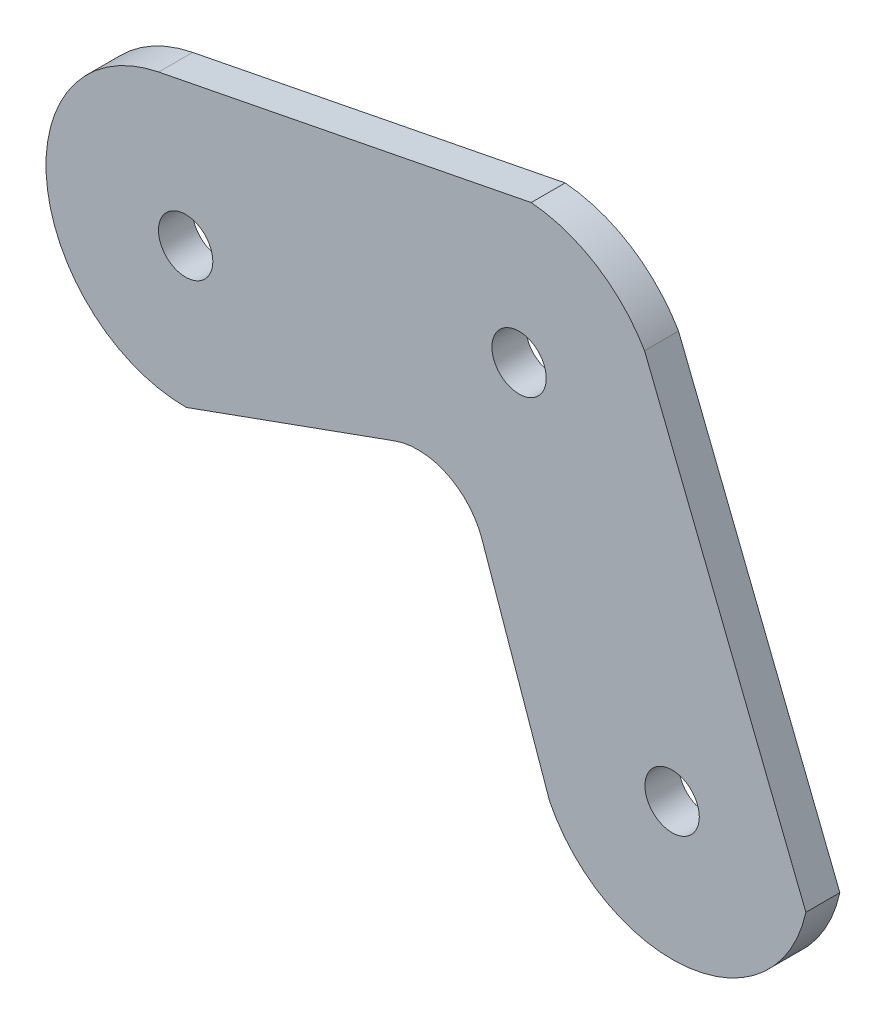
ISO-10303-21;
HEADER;
FILE_DESCRIPTION(('STEP AP214'),'2;1');
FILE_NAME('part.step','',(''),(''),'','','');
FILE_SCHEMA(('AUTOMOTIVE_DESIGN { 1 0 10303 214 1 1 1 1 }'));
ENDSEC;
DATA;
#1=APPLICATION_CONTEXT('core data for automotive mechanical design processes');
#2=APPLICATION_PROTOCOL_DEFINITION('international standard','automotive_design',2000,#1);
#3=PRODUCT_CONTEXT('',#1,'mechanical');
#4=PRODUCT('Part','Part','',(#3));
#5=PRODUCT_RELATED_PRODUCT_CATEGORY('part','',(#4));
#6=PRODUCT_DEFINITION_FORMATION('','',#4);
#7=PRODUCT_DEFINITION_CONTEXT('part definition',#1,'design');
#8=PRODUCT_DEFINITION('design','',#6,#7);
#9=PRODUCT_DEFINITION_SHAPE('','',#8);
#10=(LENGTH_UNIT() NAMED_UNIT(*) SI_UNIT(.MILLI.,.METRE.));
#11=(NAMED_UNIT(*) PLANE_ANGLE_UNIT() SI_UNIT($,.RADIAN.));
#12=(NAMED_UNIT(*) SI_UNIT($,.STERADIAN.) SOLID_ANGLE_UNIT());
#13=UNCERTAINTY_MEASURE_WITH_UNIT(LENGTH_MEASURE(1.E-05),#10,'distance_accuracy_value','');
#14=(GEOMETRIC_REPRESENTATION_CONTEXT(3) GLOBAL_UNCERTAINTY_ASSIGNED_CONTEXT((#13)) GLOBAL_UNIT_ASSIGNED_CONTEXT((#10,
#11,#12)) REPRESENTATION_CONTEXT('',''));
#15=CARTESIAN_POINT('',(0.,0.,0.));
#16=DIRECTION('',(0.,0.,1.));
#17=DIRECTION('',(1.,0.,0.));
#18=AXIS2_PLACEMENT_3D('',#15,#16,#17);
#19=CARTESIAN_POINT('',(86.39961379608,30.2365007228669,5.));
#20=DIRECTION('',(0.943869814927785,0.330317684159035,0.));
#21=DIRECTION('',(-0.330317684159035,0.943869814927785,0.));
#22=AXIS2_PLACEMENT_3D('',#19,#20,#21);
#23=PLANE('',#22);
#24=DIRECTION('',(0.330317684159035,-0.943869814927785,0.));
#25=VECTOR('',#24,1.);
#26=CARTESIAN_POINT('',(86.39961379608,30.2365007228669,0.));
#27=LINE('',#26,#25);
#28=CARTESIAN_POINT('',(79.6864116349016,49.419212352661,0.));
#29=VERTEX_POINT('',#28);
#30=CARTESIAN_POINT('',(89.6143983524071,21.0503800586389,0.));
#31=VERTEX_POINT('',#30);
#32=EDGE_CURVE('E139',#29,#31,#27,.T.);
#33=ORIENTED_EDGE('',*,*,#32,.T.);
#34=DIRECTION('',(0.,0.,-1.));
#35=VECTOR('',#34,1.);
#36=CARTESIAN_POINT('',(89.6143983524071,21.0503800586389,5.));
#37=LINE('',#36,#35);
#38=CARTESIAN_POINT('',(89.6143983524071,21.0503800586389,5.));
#39=VERTEX_POINT('',#38);
#40=EDGE_CURVE('E11',#39,#31,#37,.T.);
#41=ORIENTED_EDGE('',*,*,#40,.F.);
#42=DIRECTION('',(0.330317684159035,-0.943869814927785,0.));
#43=VECTOR('',#42,1.);
#44=CARTESIAN_POINT('',(86.39961379608,30.2365007228669,5.));
#45=LINE('',#44,#43);
#46=CARTESIAN_POINT('',(79.6864116349016,49.419212352661,5.));
#47=VERTEX_POINT('',#46);
#48=EDGE_CURVE('E184',#47,#39,#45,.T.);
#49=ORIENTED_EDGE('',*,*,#48,.F.);
#50=DIRECTION('',(0.,0.,-1.));
#51=VECTOR('',#50,1.);
#52=CARTESIAN_POINT('',(79.6864116349016,49.419212352661,5.));
#53=LINE('',#52,#51);
#54=EDGE_CURVE('E126',#47,#29,#53,.T.);
#55=ORIENTED_EDGE('',*,*,#54,.T.);
#56=EDGE_LOOP('',(#33,#41,#49,#55));
#57=FACE_BOUND('',#56,.T.);
#58=ADVANCED_FACE('F34',(#57),#23,.F.);
#59=CARTESIAN_POINT('',(107.662812973354,30.,5.));
#60=DIRECTION('',(0.,0.,-1.));
#61=DIRECTION('',(-1.,0.,0.));
#62=AXIS2_PLACEMENT_3D('',#59,#60,#61);
#63=CYLINDRICAL_SURFACE('',#62,20.1454949659822);
#64=CARTESIAN_POINT('',(107.662812973354,30.,0.));
#65=DIRECTION('',(0.,0.,1.));
#66=DIRECTION('',(1.,0.,0.));
#67=AXIS2_PLACEMENT_3D('',#64,#65,#66);
#68=CIRCLE('',#67,20.1454949659822);
#69=CARTESIAN_POINT('',(127.344312528721,25.7012161398243,0.));
#70=VERTEX_POINT('',#69);
#71=EDGE_CURVE('E142',#31,#70,#68,.T.);
#72=ORIENTED_EDGE('',*,*,#71,.T.);
#73=DIRECTION('',(0.,0.,-1.));
#74=VECTOR('',#73,1.);
#75=CARTESIAN_POINT('',(127.344312528721,25.7012161398243,5.));
#76=LINE('',#75,#74);
#77=CARTESIAN_POINT('',(127.344312528721,25.7012161398243,5.));
#78=VERTEX_POINT('',#77);
#79=EDGE_CURVE('E43',#78,#70,#76,.T.);
#80=ORIENTED_EDGE('',*,*,#79,.F.);
#81=CARTESIAN_POINT('',(107.662812973354,30.,5.));
#82=DIRECTION('',(0.,0.,1.));
#83=DIRECTION('',(1.,0.,0.));
#84=AXIS2_PLACEMENT_3D('',#81,#82,#83);
#85=CIRCLE('',#84,20.1454949659822);
#86=EDGE_CURVE('E94',#39,#78,#85,.T.);
#87=ORIENTED_EDGE('',*,*,#86,.F.);
#88=ORIENTED_EDGE('',*,*,#40,.T.);
#89=EDGE_LOOP('',(#72,#80,#87,#88));
#90=FACE_BOUND('',#89,.T.);
#91=ADVANCED_FACE('F170',(#90),#63,.T.);
#92=CARTESIAN_POINT('',(118.784113908757,47.2301621060226,5.));
#93=DIRECTION('',(0.929239436564158,0.36947810426861,0.));
#94=DIRECTION('',(-0.36947810426861,0.929239436564158,0.));
#95=AXIS2_PLACEMENT_3D('',#92,#93,#94);
#96=PLANE('',#95);
#97=DIRECTION('',(0.36947810426861,-0.929239436564158,0.));
#98=VECTOR('',#97,1.);
#99=CARTESIAN_POINT('',(118.784113908757,47.2301621060226,0.));
#100=LINE('',#99,#98);
#101=CARTESIAN_POINT('',(103.609378397983,85.394704234858,0.));
#102=VERTEX_POINT('',#101);
#103=EDGE_CURVE('E145',#102,#70,#100,.T.);
#104=ORIENTED_EDGE('',*,*,#103,.F.);
#105=DIRECTION('',(0.,0.,-1.));
#106=VECTOR('',#105,1.);
#107=CARTESIAN_POINT('',(103.609378397983,85.394704234858,5.));
#108=LINE('',#107,#106);
#109=CARTESIAN_POINT('',(103.609378397983,85.394704234858,5.));
#110=VERTEX_POINT('',#109);
#111=EDGE_CURVE('E163',#110,#102,#108,.T.);
#112=ORIENTED_EDGE('',*,*,#111,.F.);
#113=DIRECTION('',(0.36947810426861,-0.929239436564158,0.));
#114=VECTOR('',#113,1.);
#115=CARTESIAN_POINT('',(118.784113908757,47.2301621060226,5.));
#116=LINE('',#115,#114);
#117=EDGE_CURVE('E169',#110,#78,#116,.T.);
#118=ORIENTED_EDGE('',*,*,#117,.T.);
#119=ORIENTED_EDGE('',*,*,#79,.T.);
#120=EDGE_LOOP('',(#104,#112,#118,#119));
#121=FACE_BOUND('',#120,.T.);
#122=ADVANCED_FACE('F167',(#121),#96,.T.);
#123=CARTESIAN_POINT('',(85.1444462247,74.6421679466076,5.));
#124=DIRECTION('',(0.,0.,-1.));
#125=DIRECTION('',(-1.,0.,0.));
#126=AXIS2_PLACEMENT_3D('',#123,#124,#125);
#127=CYLINDRICAL_SURFACE('',#126,21.3675163927421);
#128=CARTESIAN_POINT('',(85.1444462247,74.6421679466076,0.));
#129=DIRECTION('',(0.,0.,1.));
#130=DIRECTION('',(1.,0.,0.));
#131=AXIS2_PLACEMENT_3D('',#128,#129,#130);
#132=CIRCLE('',#131,21.3675163927421);
#133=CARTESIAN_POINT('',(86.9275341363037,95.9351563299603,0.));
#134=VERTEX_POINT('',#133);
#135=EDGE_CURVE('E148',#102,#134,#132,.T.);
#136=ORIENTED_EDGE('',*,*,#135,.T.);
#137=DIRECTION('',(0.,0.,-1.));
#138=VECTOR('',#137,1.);
#139=CARTESIAN_POINT('',(86.9275341363037,95.9351563299603,5.));
#140=LINE('',#139,#138);
#141=CARTESIAN_POINT('',(86.9275341363037,95.9351563299603,5.));
#142=VERTEX_POINT('',#141);
#143=EDGE_CURVE('E161',#142,#134,#140,.T.);
#144=ORIENTED_EDGE('',*,*,#143,.F.);
#145=CARTESIAN_POINT('',(85.1444462247,74.6421679466076,5.));
#146=DIRECTION('',(0.,0.,1.));
#147=DIRECTION('',(1.,0.,0.));
#148=AXIS2_PLACEMENT_3D('',#145,#146,#147);
#149=CIRCLE('',#148,21.3675163927421);
#150=EDGE_CURVE('E181',#110,#142,#149,.T.);
#151=ORIENTED_EDGE('',*,*,#150,.F.);
#152=ORIENTED_EDGE('',*,*,#111,.T.);
#153=EDGE_LOOP('',(#136,#144,#151,#152));
#154=FACE_BOUND('',#153,.T.);
#155=ADVANCED_FACE('F179',(#154),#127,.T.);
#156=CARTESIAN_POINT('',(-14.920486041365,75.9187246819285,5.));
#157=DIRECTION('',(-0.192843358932151,0.981229554648537,0.));
#158=DIRECTION('',(-0.981229554648537,-0.192843358932151,0.));
#159=AXIS2_PLACEMENT_3D('',#156,#157,#158);
#160=PLANE('',#159);
#161=DIRECTION('',(0.981229554648537,0.192843358932151,0.));
#162=VECTOR('',#161,1.);
#163=CARTESIAN_POINT('',(-14.920486041365,75.9187246819285,0.));
#164=LINE('',#163,#162);
#165=CARTESIAN_POINT('',(32.1201429811577,85.1637304647331,0.));
#166=VERTEX_POINT('',#165);
#167=EDGE_CURVE('E151',#166,#134,#164,.T.);
#168=ORIENTED_EDGE('',*,*,#167,.F.);
#169=DIRECTION('',(0.,0.,-1.));
#170=VECTOR('',#169,1.);
#171=CARTESIAN_POINT('',(32.1201429811577,85.1637304647331,5.));
#172=LINE('',#171,#170);
#173=CARTESIAN_POINT('',(32.1201429811577,85.1637304647331,5.));
#174=VERTEX_POINT('',#173);
#175=EDGE_CURVE('E121',#174,#166,#172,.T.);
#176=ORIENTED_EDGE('',*,*,#175,.F.);
#177=DIRECTION('',(0.981229554648537,0.192843358932151,0.));
#178=VECTOR('',#177,1.);
#179=CARTESIAN_POINT('',(-14.920486041365,75.9187246819285,5.));
#180=LINE('',#179,#178);
#181=EDGE_CURVE('E114',#174,#142,#180,.T.);
#182=ORIENTED_EDGE('',*,*,#181,.T.);
#183=ORIENTED_EDGE('',*,*,#143,.T.);
#184=EDGE_LOOP('',(#168,#176,#182,#183));
#185=FACE_BOUND('',#184,.T.);
#186=ADVANCED_FACE('F188',(#185),#160,.T.);
#187=CARTESIAN_POINT('',(36.0829684922731,65.,5.));
#188=DIRECTION('',(0.,0.,-1.));
#189=DIRECTION('',(-1.,0.,0.));
#190=AXIS2_PLACEMENT_3D('',#187,#188,#189);
#191=CYLINDRICAL_SURFACE('',#190,20.5494528463887);
#192=CARTESIAN_POINT('',(36.0829684922731,65.,0.));
#193=DIRECTION('',(0.,0.,1.));
#194=DIRECTION('',(1.,0.,0.));
#195=AXIS2_PLACEMENT_3D('',#192,#193,#194);
#196=CIRCLE('',#195,20.5494528463887);
#197=CARTESIAN_POINT('',(36.1784462583173,44.4507689612933,0.));
#198=VERTEX_POINT('',#197);
#199=EDGE_CURVE('E120',#166,#198,#196,.T.);
#200=ORIENTED_EDGE('',*,*,#199,.T.);
#201=DIRECTION('',(0.,0.,-1.));
#202=VECTOR('',#201,1.);
#203=CARTESIAN_POINT('',(36.1784462583173,44.4507689612933,5.));
#204=LINE('',#203,#202);
#205=CARTESIAN_POINT('',(36.1784462583173,44.4507689612933,5.));
#206=VERTEX_POINT('',#205);
#207=EDGE_CURVE('E117',#206,#198,#204,.T.);
#208=ORIENTED_EDGE('',*,*,#207,.F.);
#209=CARTESIAN_POINT('',(36.0829684922731,65.,5.));
#210=DIRECTION('',(0.,0.,1.));
#211=DIRECTION('',(1.,0.,0.));
#212=AXIS2_PLACEMENT_3D('',#209,#210,#211);
#213=CIRCLE('',#212,20.5494528463887);
#214=EDGE_CURVE('E108',#174,#206,#213,.T.);
#215=ORIENTED_EDGE('',*,*,#214,.F.);
#216=ORIENTED_EDGE('',*,*,#175,.T.);
#217=EDGE_LOOP('',(#200,#208,#215,#216));
#218=FACE_BOUND('',#217,.T.);
#219=ADVANCED_FACE('F118',(#218),#191,.T.);
#220=CARTESIAN_POINT('',(-10.024729896828,27.774560453859,5.));
#221=DIRECTION('',(-0.339495488233636,0.940607683079936,0.));
#222=DIRECTION('',(-0.940607683079936,-0.339495488233636,0.));
#223=AXIS2_PLACEMENT_3D('',#220,#221,#222);
#224=PLANE('',#223);
#225=DIRECTION('',(0.940607683079936,0.339495488233636,0.));
#226=VECTOR('',#225,1.);
#227=CARTESIAN_POINT('',(-10.024729896828,27.774560453859,0.));
#228=LINE('',#227,#226);
#229=CARTESIAN_POINT('',(66.8527586032873,55.5221123418701,0.));
#230=VERTEX_POINT('',#229);
#231=EDGE_CURVE('E80',#198,#230,#228,.T.);
#232=ORIENTED_EDGE('',*,*,#231,.T.);
#233=DIRECTION('',(0.,0.,-1.));
#234=VECTOR('',#233,1.);
#235=CARTESIAN_POINT('',(66.8527586032873,55.5221123418701,5.));
#236=LINE('',#235,#234);
#237=CARTESIAN_POINT('',(66.8527586032873,55.5221123418701,5.));
#238=VERTEX_POINT('',#237);
#239=EDGE_CURVE('E122',#238,#230,#236,.T.);
#240=ORIENTED_EDGE('',*,*,#239,.F.);
#241=DIRECTION('',(0.940607683079936,0.339495488233636,0.));
#242=VECTOR('',#241,1.);
#243=CARTESIAN_POINT('',(-10.024729896828,27.774560453859,5.));
#244=LINE('',#243,#242);
#245=EDGE_CURVE('E112',#206,#238,#244,.T.);
#246=ORIENTED_EDGE('',*,*,#245,.F.);
#247=ORIENTED_EDGE('',*,*,#207,.T.);
#248=EDGE_LOOP('',(#232,#240,#246,#247));
#249=FACE_BOUND('',#248,.T.);
#250=ADVANCED_FACE('F124',(#249),#224,.F.);
#251=CARTESIAN_POINT('',(107.662812973354,30.,5.));
#252=DIRECTION('',(0.,0.,-1.));
#253=DIRECTION('',(-1.,0.,0.));
#254=AXIS2_PLACEMENT_3D('',#251,#252,#253);
#255=CYLINDRICAL_SURFACE('',#254,3.99999999999999);
#256=CARTESIAN_POINT('',(107.662812973354,30.,5.));
#257=DIRECTION('',(0.,0.,1.));
#258=DIRECTION('',(1.,0.,0.));
#259=AXIS2_PLACEMENT_3D('',#256,#257,#258);
#260=CIRCLE('',#259,3.99999999999999);
#261=CARTESIAN_POINT('',(111.662812973354,30.,5.));
#262=VERTEX_POINT('',#261);
#263=EDGE_CURVE('E319',#262,#262,#260,.T.);
#264=ORIENTED_EDGE('',*,*,#263,.T.);
#265=EDGE_LOOP('',(#264));
#266=FACE_BOUND('',#265,.T.);
#267=CARTESIAN_POINT('',(107.662812973354,30.,0.));
#268=DIRECTION('',(0.,0.,1.));
#269=DIRECTION('',(1.,0.,0.));
#270=AXIS2_PLACEMENT_3D('',#267,#268,#269);
#271=CIRCLE('',#270,3.99999999999999);
#272=CARTESIAN_POINT('',(111.662812973354,30.,0.));
#273=VERTEX_POINT('',#272);
#274=EDGE_CURVE('E136',#273,#273,#271,.T.);
#275=ORIENTED_EDGE('',*,*,#274,.F.);
#276=EDGE_LOOP('',(#275));
#277=FACE_BOUND('',#276,.T.);
#278=ADVANCED_FACE('F212',(#266,#277),#255,.F.);
#279=CARTESIAN_POINT('',(85.1444462247,74.6421679466076,5.));
#280=DIRECTION('',(0.,0.,-1.));
#281=DIRECTION('',(-1.,0.,0.));
#282=AXIS2_PLACEMENT_3D('',#279,#280,#281);
#283=CYLINDRICAL_SURFACE('',#282,4.00000000000001);
#284=CARTESIAN_POINT('',(85.1444462247,74.6421679466076,5.));
#285=DIRECTION('',(0.,0.,1.));
#286=DIRECTION('',(1.,0.,0.));
#287=AXIS2_PLACEMENT_3D('',#284,#285,#286);
#288=CIRCLE('',#287,4.00000000000001);
#289=CARTESIAN_POINT('',(89.1444462247,74.6421679466076,5.));
#290=VERTEX_POINT('',#289);
#291=EDGE_CURVE('E222',#290,#290,#288,.T.);
#292=ORIENTED_EDGE('',*,*,#291,.T.);
#293=EDGE_LOOP('',(#292));
#294=FACE_BOUND('',#293,.T.);
#295=CARTESIAN_POINT('',(85.1444462247,74.6421679466076,0.));
#296=DIRECTION('',(0.,0.,1.));
#297=DIRECTION('',(1.,0.,0.));
#298=AXIS2_PLACEMENT_3D('',#295,#296,#297);
#299=CIRCLE('',#298,4.00000000000001);
#300=CARTESIAN_POINT('',(89.1444462247,74.6421679466076,0.));
#301=VERTEX_POINT('',#300);
#302=EDGE_CURVE('E133',#301,#301,#299,.T.);
#303=ORIENTED_EDGE('',*,*,#302,.F.);
#304=EDGE_LOOP('',(#303));
#305=FACE_BOUND('',#304,.T.);
#306=ADVANCED_FACE('F200',(#294,#305),#283,.F.);
#307=CARTESIAN_POINT('',(36.0829684922731,65.,5.));
#308=DIRECTION('',(0.,0.,-1.));
#309=DIRECTION('',(-1.,0.,0.));
#310=AXIS2_PLACEMENT_3D('',#307,#308,#309);
#311=CYLINDRICAL_SURFACE('',#310,4.00000000000001);
#312=CARTESIAN_POINT('',(36.0829684922731,65.,5.));
#313=DIRECTION('',(0.,0.,1.));
#314=DIRECTION('',(1.,0.,0.));
#315=AXIS2_PLACEMENT_3D('',#312,#313,#314);
#316=CIRCLE('',#315,4.00000000000001);
#317=CARTESIAN_POINT('',(40.0829684922731,65.,5.));
#318=VERTEX_POINT('',#317);
#319=EDGE_CURVE('E157',#318,#318,#316,.T.);
#320=ORIENTED_EDGE('',*,*,#319,.T.);
#321=EDGE_LOOP('',(#320));
#322=FACE_BOUND('',#321,.T.);
#323=CARTESIAN_POINT('',(36.0829684922731,65.,0.));
#324=DIRECTION('',(0.,0.,1.));
#325=DIRECTION('',(1.,0.,0.));
#326=AXIS2_PLACEMENT_3D('',#323,#324,#325);
#327=CIRCLE('',#326,4.00000000000001);
#328=CARTESIAN_POINT('',(40.0829684922731,65.,0.));
#329=VERTEX_POINT('',#328);
#330=EDGE_CURVE('E130',#329,#329,#327,.T.);
#331=ORIENTED_EDGE('',*,*,#330,.F.);
#332=EDGE_LOOP('',(#331));
#333=FACE_BOUND('',#332,.T.);
#334=ADVANCED_FACE('F36',(#322,#333),#311,.F.);
#335=CARTESIAN_POINT('',(70.2477134856237,46.1160355110707,5.));
#336=DIRECTION('',(0.,0.,-1.));
#337=DIRECTION('',(-1.,0.,0.));
#338=AXIS2_PLACEMENT_3D('',#335,#336,#337);
#339=CYLINDRICAL_SURFACE('',#338,10.);
#340=CARTESIAN_POINT('',(70.2477134856237,46.1160355110707,0.));
#341=DIRECTION('',(0.,0.,1.));
#342=DIRECTION('',(1.,0.,0.));
#343=AXIS2_PLACEMENT_3D('',#340,#341,#342);
#344=CIRCLE('',#343,10.);
#345=EDGE_CURVE('E86',#230,#29,#344,.F.);
#346=ORIENTED_EDGE('',*,*,#345,.T.);
#347=ORIENTED_EDGE('',*,*,#54,.F.);
#348=CARTESIAN_POINT('',(70.2477134856237,46.1160355110707,5.));
#349=DIRECTION('',(0.,0.,1.));
#350=DIRECTION('',(1.,0.,0.));
#351=AXIS2_PLACEMENT_3D('',#348,#349,#350);
#352=CIRCLE('',#351,10.);
#353=EDGE_CURVE('E51',#238,#47,#352,.F.);
#354=ORIENTED_EDGE('',*,*,#353,.F.);
#355=ORIENTED_EDGE('',*,*,#239,.T.);
#356=EDGE_LOOP('',(#346,#347,#354,#355));
#357=FACE_BOUND('',#356,.T.);
#358=ADVANCED_FACE('F191',(#357),#339,.F.);
#359=CARTESIAN_POINT('',(0.,0.,5.));
#360=DIRECTION('',(0.,0.,1.));
#361=DIRECTION('',(1.,0.,0.));
#362=AXIS2_PLACEMENT_3D('',#359,#360,#361);
#363=PLANE('',#362);
#364=ORIENTED_EDGE('',*,*,#319,.F.);
#365=EDGE_LOOP('',(#364));
#366=FACE_BOUND('',#365,.T.);
#367=ORIENTED_EDGE('',*,*,#291,.F.);
#368=EDGE_LOOP('',(#367));
#369=FACE_BOUND('',#368,.T.);
#370=ORIENTED_EDGE('',*,*,#263,.F.);
#371=EDGE_LOOP('',(#370));
#372=FACE_BOUND('',#371,.T.);
#373=ORIENTED_EDGE('',*,*,#48,.T.);
#374=ORIENTED_EDGE('',*,*,#86,.T.);
#375=ORIENTED_EDGE('',*,*,#117,.F.);
#376=ORIENTED_EDGE('',*,*,#150,.T.);
#377=ORIENTED_EDGE('',*,*,#181,.F.);
#378=ORIENTED_EDGE('',*,*,#214,.T.);
#379=ORIENTED_EDGE('',*,*,#245,.T.);
#380=ORIENTED_EDGE('',*,*,#353,.T.);
#381=EDGE_LOOP('',(#373,#374,#375,#376,#377,#378,#379,#380));
#382=FACE_BOUND('',#381,.T.);
#383=ADVANCED_FACE('F110',(#366,#369,#372,#382),#363,.T.);
#384=CARTESIAN_POINT('',(0.,0.,0.));
#385=DIRECTION('',(0.,0.,1.));
#386=DIRECTION('',(1.,0.,0.));
#387=AXIS2_PLACEMENT_3D('',#384,#385,#386);
#388=PLANE('',#387);
#389=ORIENTED_EDGE('',*,*,#330,.T.);
#390=EDGE_LOOP('',(#389));
#391=FACE_BOUND('',#390,.T.);
#392=ORIENTED_EDGE('',*,*,#302,.T.);
#393=EDGE_LOOP('',(#392));
#394=FACE_BOUND('',#393,.T.);
#395=ORIENTED_EDGE('',*,*,#274,.T.);
#396=EDGE_LOOP('',(#395));
#397=FACE_BOUND('',#396,.T.);
#398=ORIENTED_EDGE('',*,*,#32,.F.);
#399=ORIENTED_EDGE('',*,*,#345,.F.);
#400=ORIENTED_EDGE('',*,*,#231,.F.);
#401=ORIENTED_EDGE('',*,*,#199,.F.);
#402=ORIENTED_EDGE('',*,*,#167,.T.);
#403=ORIENTED_EDGE('',*,*,#135,.F.);
#404=ORIENTED_EDGE('',*,*,#103,.T.);
#405=ORIENTED_EDGE('',*,*,#71,.F.);
#406=EDGE_LOOP('',(#398,#399,#400,#401,#402,#403,#404,#405));
#407=FACE_BOUND('',#406,.T.);
#408=ADVANCED_FACE('F175',(#391,#394,#397,#407),#388,.F.);
#409=CLOSED_SHELL('',(#58,#91,#122,#155,#186,#219,#250,#278,#306,#334,#358,#383,#408));
#410=MANIFOLD_SOLID_BREP('B2',#409);
#411=ADVANCED_BREP_SHAPE_REPRESENTATION('',(#18,#410),#14);
#412=SHAPE_DEFINITION_REPRESENTATION(#9,#411);
ENDSEC;
END-ISO-10303-21;
